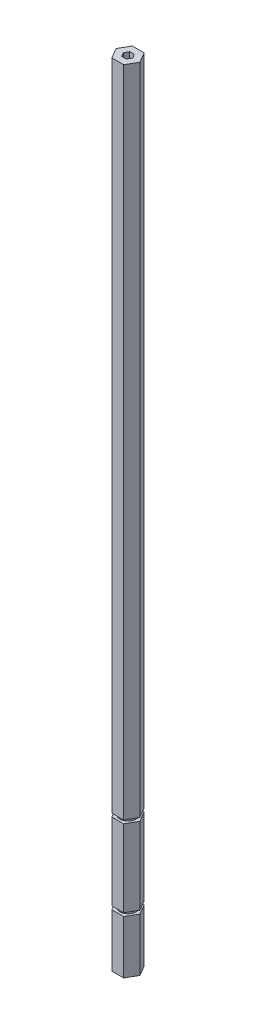
ISO-10303-21;
HEADER;
FILE_DESCRIPTION(('STEP AP214'),'2;1');
FILE_NAME('part.step','',(''),(''),'','','');
FILE_SCHEMA(('AUTOMOTIVE_DESIGN { 1 0 10303 214 1 1 1 1 }'));
ENDSEC;
DATA;
#1=APPLICATION_CONTEXT('core data for automotive mechanical design processes');
#2=APPLICATION_PROTOCOL_DEFINITION('international standard','automotive_design',2000,#1);
#3=PRODUCT_CONTEXT('',#1,'mechanical');
#4=PRODUCT('Part','Part','',(#3));
#5=PRODUCT_RELATED_PRODUCT_CATEGORY('part','',(#4));
#6=PRODUCT_DEFINITION_FORMATION('','',#4);
#7=PRODUCT_DEFINITION_CONTEXT('part definition',#1,'design');
#8=PRODUCT_DEFINITION('design','',#6,#7);
#9=PRODUCT_DEFINITION_SHAPE('','',#8);
#10=(LENGTH_UNIT() NAMED_UNIT(*) SI_UNIT(.MILLI.,.METRE.));
#11=(NAMED_UNIT(*) PLANE_ANGLE_UNIT() SI_UNIT($,.RADIAN.));
#12=(NAMED_UNIT(*) SI_UNIT($,.STERADIAN.) SOLID_ANGLE_UNIT());
#13=UNCERTAINTY_MEASURE_WITH_UNIT(LENGTH_MEASURE(1.E-05),#10,'distance_accuracy_value','');
#14=(GEOMETRIC_REPRESENTATION_CONTEXT(3) GLOBAL_UNCERTAINTY_ASSIGNED_CONTEXT((#13)) GLOBAL_UNIT_ASSIGNED_CONTEXT((#10,
#11,#12)) REPRESENTATION_CONTEXT('',''));
#15=CARTESIAN_POINT('',(0.,0.,0.));
#16=DIRECTION('',(0.,0.,1.));
#17=DIRECTION('',(1.,0.,0.));
#18=AXIS2_PLACEMENT_3D('',#15,#16,#17);
#19=CARTESIAN_POINT('',(3.66617420935412,488.95,6.35));
#20=DIRECTION('',(-0.866025403784439,0.,-0.5));
#21=DIRECTION('',(-0.5,0.,0.866025403784439));
#22=AXIS2_PLACEMENT_3D('',#19,#20,#21);
#23=PLANE('',#22);
#24=DIRECTION('',(-0.5,0.,0.866025403784439));
#25=VECTOR('',#24,1.);
#26=CARTESIAN_POINT('',(3.66617420935412,84.582,6.35));
#27=LINE('',#26,#25);
#28=CARTESIAN_POINT('',(7.33234841870825,84.582,0.));
#29=VERTEX_POINT('',#28);
#30=CARTESIAN_POINT('',(3.66617420935412,84.582,6.35));
#31=VERTEX_POINT('',#30);
#32=EDGE_CURVE('E330',#29,#31,#27,.T.);
#33=ORIENTED_EDGE('',*,*,#32,.F.);
#34=DIRECTION('',(0.,-1.,0.));
#35=VECTOR('',#34,1.);
#36=CARTESIAN_POINT('',(7.33234841870825,488.95,0.));
#37=LINE('',#36,#35);
#38=CARTESIAN_POINT('',(7.33234841870825,488.95,0.));
#39=VERTEX_POINT('',#38);
#40=EDGE_CURVE('E221',#39,#29,#37,.T.);
#41=ORIENTED_EDGE('',*,*,#40,.F.);
#42=DIRECTION('',(0.5,0.,-0.866025403784438));
#43=VECTOR('',#42,1.);
#44=CARTESIAN_POINT('',(3.66617420935412,488.95,6.35));
#45=LINE('',#44,#43);
#46=CARTESIAN_POINT('',(3.66617420935412,488.95,6.35));
#47=VERTEX_POINT('',#46);
#48=EDGE_CURVE('E329',#47,#39,#45,.T.);
#49=ORIENTED_EDGE('',*,*,#48,.F.);
#50=DIRECTION('',(0.,-1.,0.));
#51=VECTOR('',#50,1.);
#52=CARTESIAN_POINT('',(3.66617420935412,488.95,6.35));
#53=LINE('',#52,#51);
#54=EDGE_CURVE('E240',#47,#31,#53,.T.);
#55=ORIENTED_EDGE('',*,*,#54,.T.);
#56=EDGE_LOOP('',(#33,#41,#49,#55));
#57=FACE_BOUND('',#56,.T.);
#58=ADVANCED_FACE('F45',(#57),#23,.F.);
#59=DIRECTION('',(0.5,0.,-0.866025403784439));
#60=VECTOR('',#59,1.);
#61=CARTESIAN_POINT('',(3.66617420935412,32.893,6.35));
#62=LINE('',#61,#60);
#63=CARTESIAN_POINT('',(3.66617420935412,32.893,6.35));
#64=VERTEX_POINT('',#63);
#65=CARTESIAN_POINT('',(7.33234841870825,32.893,0.));
#66=VERTEX_POINT('',#65);
#67=EDGE_CURVE('E215',#64,#66,#62,.T.);
#68=ORIENTED_EDGE('',*,*,#67,.F.);
#69=CARTESIAN_POINT('',(3.66617420935412,0.,6.35));
#70=VERTEX_POINT('',#69);
#71=EDGE_CURVE('E227',#64,#70,#53,.T.);
#72=ORIENTED_EDGE('',*,*,#71,.T.);
#73=DIRECTION('',(0.5,0.,-0.866025403784438));
#74=VECTOR('',#73,1.);
#75=CARTESIAN_POINT('',(3.66617420935412,0.,6.35));
#76=LINE('',#75,#74);
#77=CARTESIAN_POINT('',(7.33234841870825,0.,0.));
#78=VERTEX_POINT('',#77);
#79=EDGE_CURVE('E399',#70,#78,#76,.T.);
#80=ORIENTED_EDGE('',*,*,#79,.T.);
#81=EDGE_CURVE('E229',#66,#78,#37,.T.);
#82=ORIENTED_EDGE('',*,*,#81,.F.);
#83=EDGE_LOOP('',(#68,#72,#80,#82));
#84=FACE_BOUND('',#83,.T.);
#85=ADVANCED_FACE('F225',(#84),#23,.F.);
#86=CARTESIAN_POINT('',(7.33234841870825,488.95,0.));
#87=DIRECTION('',(-0.866025403784439,0.,0.5));
#88=DIRECTION('',(0.5,0.,0.866025403784439));
#89=AXIS2_PLACEMENT_3D('',#86,#87,#88);
#90=PLANE('',#89);
#91=DIRECTION('',(0.5,0.,0.866025403784439));
#92=VECTOR('',#91,1.);
#93=CARTESIAN_POINT('',(7.33234841870825,84.582,0.));
#94=LINE('',#93,#92);
#95=CARTESIAN_POINT('',(3.66617420935412,84.582,-6.35));
#96=VERTEX_POINT('',#95);
#97=EDGE_CURVE('E326',#96,#29,#94,.T.);
#98=ORIENTED_EDGE('',*,*,#97,.F.);
#99=DIRECTION('',(0.,-1.,0.));
#100=VECTOR('',#99,1.);
#101=CARTESIAN_POINT('',(3.66617420935412,488.95,-6.35));
#102=LINE('',#101,#100);
#103=CARTESIAN_POINT('',(3.66617420935412,488.95,-6.35));
#104=VERTEX_POINT('',#103);
#105=EDGE_CURVE('E303',#104,#96,#102,.T.);
#106=ORIENTED_EDGE('',*,*,#105,.F.);
#107=DIRECTION('',(-0.5,0.,-0.866025403784439));
#108=VECTOR('',#107,1.);
#109=CARTESIAN_POINT('',(7.33234841870825,488.95,0.));
#110=LINE('',#109,#108);
#111=EDGE_CURVE('E327',#39,#104,#110,.T.);
#112=ORIENTED_EDGE('',*,*,#111,.F.);
#113=ORIENTED_EDGE('',*,*,#40,.T.);
#114=EDGE_LOOP('',(#98,#106,#112,#113));
#115=FACE_BOUND('',#114,.T.);
#116=ADVANCED_FACE('F325',(#115),#90,.F.);
#117=DIRECTION('',(-0.5,0.,-0.866025403784439));
#118=VECTOR('',#117,1.);
#119=CARTESIAN_POINT('',(7.33234841870825,32.893,0.));
#120=LINE('',#119,#118);
#121=CARTESIAN_POINT('',(3.66617420935412,32.893,-6.35));
#122=VERTEX_POINT('',#121);
#123=EDGE_CURVE('E231',#66,#122,#120,.T.);
#124=ORIENTED_EDGE('',*,*,#123,.F.);
#125=ORIENTED_EDGE('',*,*,#81,.T.);
#126=DIRECTION('',(-0.5,0.,-0.866025403784439));
#127=VECTOR('',#126,1.);
#128=CARTESIAN_POINT('',(7.33234841870825,0.,0.));
#129=LINE('',#128,#127);
#130=CARTESIAN_POINT('',(3.66617420935412,0.,-6.35));
#131=VERTEX_POINT('',#130);
#132=EDGE_CURVE('E411',#78,#131,#129,.T.);
#133=ORIENTED_EDGE('',*,*,#132,.T.);
#134=EDGE_CURVE('E296',#122,#131,#102,.T.);
#135=ORIENTED_EDGE('',*,*,#134,.F.);
#136=EDGE_LOOP('',(#124,#125,#133,#135));
#137=FACE_BOUND('',#136,.T.);
#138=ADVANCED_FACE('F425',(#137),#90,.F.);
#139=CARTESIAN_POINT('',(3.66617420935412,488.95,-6.35));
#140=DIRECTION('',(0.,0.,1.));
#141=DIRECTION('',(1.,0.,0.));
#142=AXIS2_PLACEMENT_3D('',#139,#140,#141);
#143=PLANE('',#142);
#144=DIRECTION('',(1.,0.,0.));
#145=VECTOR('',#144,1.);
#146=CARTESIAN_POINT('',(3.66617420935412,84.582,-6.35));
#147=LINE('',#146,#145);
#148=CARTESIAN_POINT('',(-3.66617420935412,84.582,-6.35));
#149=VERTEX_POINT('',#148);
#150=EDGE_CURVE('E336',#149,#96,#147,.T.);
#151=ORIENTED_EDGE('',*,*,#150,.F.);
#152=DIRECTION('',(0.,-1.,0.));
#153=VECTOR('',#152,1.);
#154=CARTESIAN_POINT('',(-3.66617420935412,488.95,-6.35));
#155=LINE('',#154,#153);
#156=CARTESIAN_POINT('',(-3.66617420935412,488.95,-6.35));
#157=VERTEX_POINT('',#156);
#158=EDGE_CURVE('E287',#157,#149,#155,.T.);
#159=ORIENTED_EDGE('',*,*,#158,.F.);
#160=DIRECTION('',(-1.,0.,0.));
#161=VECTOR('',#160,1.);
#162=CARTESIAN_POINT('',(3.66617420935412,488.95,-6.35));
#163=LINE('',#162,#161);
#164=EDGE_CURVE('E402',#104,#157,#163,.T.);
#165=ORIENTED_EDGE('',*,*,#164,.F.);
#166=ORIENTED_EDGE('',*,*,#105,.T.);
#167=EDGE_LOOP('',(#151,#159,#165,#166));
#168=FACE_BOUND('',#167,.T.);
#169=ADVANCED_FACE('F448',(#168),#143,.F.);
#170=DIRECTION('',(-1.,0.,0.));
#171=VECTOR('',#170,1.);
#172=CARTESIAN_POINT('',(3.66617420935412,32.893,-6.35));
#173=LINE('',#172,#171);
#174=CARTESIAN_POINT('',(-3.66617420935412,32.893,-6.35));
#175=VERTEX_POINT('',#174);
#176=EDGE_CURVE('E426',#122,#175,#173,.T.);
#177=ORIENTED_EDGE('',*,*,#176,.F.);
#178=ORIENTED_EDGE('',*,*,#134,.T.);
#179=DIRECTION('',(-1.,0.,0.));
#180=VECTOR('',#179,1.);
#181=CARTESIAN_POINT('',(3.66617420935412,0.,-6.35));
#182=LINE('',#181,#180);
#183=CARTESIAN_POINT('',(-3.66617420935412,0.,-6.35));
#184=VERTEX_POINT('',#183);
#185=EDGE_CURVE('E413',#131,#184,#182,.T.);
#186=ORIENTED_EDGE('',*,*,#185,.T.);
#187=EDGE_CURVE('E279',#175,#184,#155,.T.);
#188=ORIENTED_EDGE('',*,*,#187,.F.);
#189=EDGE_LOOP('',(#177,#178,#186,#188));
#190=FACE_BOUND('',#189,.T.);
#191=ADVANCED_FACE('F493',(#190),#143,.F.);
#192=CARTESIAN_POINT('',(-3.66617420935412,488.95,-6.35));
#193=DIRECTION('',(0.866025403784438,0.,0.5));
#194=DIRECTION('',(0.5,0.,-0.866025403784439));
#195=AXIS2_PLACEMENT_3D('',#192,#193,#194);
#196=PLANE('',#195);
#197=DIRECTION('',(0.5,0.,-0.866025403784439));
#198=VECTOR('',#197,1.);
#199=CARTESIAN_POINT('',(-3.66617420935412,84.582,-6.35));
#200=LINE('',#199,#198);
#201=CARTESIAN_POINT('',(-7.33234841870825,84.582,0.));
#202=VERTEX_POINT('',#201);
#203=EDGE_CURVE('E444',#202,#149,#200,.T.);
#204=ORIENTED_EDGE('',*,*,#203,.F.);
#205=DIRECTION('',(0.,-1.,0.));
#206=VECTOR('',#205,1.);
#207=CARTESIAN_POINT('',(-7.33234841870825,488.95,0.));
#208=LINE('',#207,#206);
#209=CARTESIAN_POINT('',(-7.33234841870825,488.95,0.));
#210=VERTEX_POINT('',#209);
#211=EDGE_CURVE('E270',#210,#202,#208,.T.);
#212=ORIENTED_EDGE('',*,*,#211,.F.);
#213=DIRECTION('',(-0.5,0.,0.866025403784438));
#214=VECTOR('',#213,1.);
#215=CARTESIAN_POINT('',(-3.66617420935412,488.95,-6.35));
#216=LINE('',#215,#214);
#217=EDGE_CURVE('E405',#157,#210,#216,.T.);
#218=ORIENTED_EDGE('',*,*,#217,.F.);
#219=ORIENTED_EDGE('',*,*,#158,.T.);
#220=EDGE_LOOP('',(#204,#212,#218,#219));
#221=FACE_BOUND('',#220,.T.);
#222=ADVANCED_FACE('F449',(#221),#196,.F.);
#223=DIRECTION('',(-0.5,0.,0.866025403784439));
#224=VECTOR('',#223,1.);
#225=CARTESIAN_POINT('',(-3.66617420935412,32.893,-6.35));
#226=LINE('',#225,#224);
#227=CARTESIAN_POINT('',(-7.33234841870825,32.893,0.));
#228=VERTEX_POINT('',#227);
#229=EDGE_CURVE('E428',#175,#228,#226,.T.);
#230=ORIENTED_EDGE('',*,*,#229,.F.);
#231=ORIENTED_EDGE('',*,*,#187,.T.);
#232=DIRECTION('',(-0.5,0.,0.866025403784438));
#233=VECTOR('',#232,1.);
#234=CARTESIAN_POINT('',(-3.66617420935412,0.,-6.35));
#235=LINE('',#234,#233);
#236=CARTESIAN_POINT('',(-7.33234841870825,0.,0.));
#237=VERTEX_POINT('',#236);
#238=EDGE_CURVE('E415',#184,#237,#235,.T.);
#239=ORIENTED_EDGE('',*,*,#238,.T.);
#240=EDGE_CURVE('E262',#228,#237,#208,.T.);
#241=ORIENTED_EDGE('',*,*,#240,.F.);
#242=EDGE_LOOP('',(#230,#231,#239,#241));
#243=FACE_BOUND('',#242,.T.);
#244=ADVANCED_FACE('F487',(#243),#196,.F.);
#245=CARTESIAN_POINT('',(-7.33234841870825,488.95,0.));
#246=DIRECTION('',(0.866025403784439,0.,-0.5));
#247=DIRECTION('',(-0.5,0.,-0.866025403784439));
#248=AXIS2_PLACEMENT_3D('',#245,#246,#247);
#249=PLANE('',#248);
#250=DIRECTION('',(-0.5,0.,-0.866025403784439));
#251=VECTOR('',#250,1.);
#252=CARTESIAN_POINT('',(-7.33234841870825,84.582,0.));
#253=LINE('',#252,#251);
#254=CARTESIAN_POINT('',(-3.66617420935412,84.582,6.35));
#255=VERTEX_POINT('',#254);
#256=EDGE_CURVE('E441',#255,#202,#253,.T.);
#257=ORIENTED_EDGE('',*,*,#256,.F.);
#258=DIRECTION('',(0.,-1.,0.));
#259=VECTOR('',#258,1.);
#260=CARTESIAN_POINT('',(-3.66617420935412,488.95,6.35));
#261=LINE('',#260,#259);
#262=CARTESIAN_POINT('',(-3.66617420935412,488.95,6.35));
#263=VERTEX_POINT('',#262);
#264=EDGE_CURVE('E256',#263,#255,#261,.T.);
#265=ORIENTED_EDGE('',*,*,#264,.F.);
#266=DIRECTION('',(0.5,0.,0.866025403784439));
#267=VECTOR('',#266,1.);
#268=CARTESIAN_POINT('',(-7.33234841870825,488.95,0.));
#269=LINE('',#268,#267);
#270=EDGE_CURVE('E242',#210,#263,#269,.T.);
#271=ORIENTED_EDGE('',*,*,#270,.F.);
#272=ORIENTED_EDGE('',*,*,#211,.T.);
#273=EDGE_LOOP('',(#257,#265,#271,#272));
#274=FACE_BOUND('',#273,.T.);
#275=ADVANCED_FACE('F495',(#274),#249,.F.);
#276=DIRECTION('',(0.5,0.,0.866025403784439));
#277=VECTOR('',#276,1.);
#278=CARTESIAN_POINT('',(-7.33234841870825,32.893,0.));
#279=LINE('',#278,#277);
#280=CARTESIAN_POINT('',(-3.66617420935412,32.893,6.35));
#281=VERTEX_POINT('',#280);
#282=EDGE_CURVE('E60',#228,#281,#279,.T.);
#283=ORIENTED_EDGE('',*,*,#282,.F.);
#284=ORIENTED_EDGE('',*,*,#240,.T.);
#285=DIRECTION('',(0.5,0.,0.866025403784439));
#286=VECTOR('',#285,1.);
#287=CARTESIAN_POINT('',(-7.33234841870825,0.,0.));
#288=LINE('',#287,#286);
#289=CARTESIAN_POINT('',(-3.66617420935412,0.,6.35));
#290=VERTEX_POINT('',#289);
#291=EDGE_CURVE('E417',#237,#290,#288,.T.);
#292=ORIENTED_EDGE('',*,*,#291,.T.);
#293=EDGE_CURVE('E248',#281,#290,#261,.T.);
#294=ORIENTED_EDGE('',*,*,#293,.F.);
#295=EDGE_LOOP('',(#283,#284,#292,#294));
#296=FACE_BOUND('',#295,.T.);
#297=ADVANCED_FACE('F419',(#296),#249,.F.);
#298=CARTESIAN_POINT('',(-3.66617420935412,488.95,6.35));
#299=DIRECTION('',(0.,0.,-1.));
#300=DIRECTION('',(-1.,0.,0.));
#301=AXIS2_PLACEMENT_3D('',#298,#299,#300);
#302=PLANE('',#301);
#303=DIRECTION('',(-1.,0.,0.));
#304=VECTOR('',#303,1.);
#305=CARTESIAN_POINT('',(-3.66617420935412,84.582,6.35));
#306=LINE('',#305,#304);
#307=EDGE_CURVE('E53',#31,#255,#306,.T.);
#308=ORIENTED_EDGE('',*,*,#307,.F.);
#309=ORIENTED_EDGE('',*,*,#54,.F.);
#310=DIRECTION('',(1.,0.,0.));
#311=VECTOR('',#310,1.);
#312=CARTESIAN_POINT('',(-3.66617420935412,488.95,6.35));
#313=LINE('',#312,#311);
#314=EDGE_CURVE('E238',#263,#47,#313,.T.);
#315=ORIENTED_EDGE('',*,*,#314,.F.);
#316=ORIENTED_EDGE('',*,*,#264,.T.);
#317=EDGE_LOOP('',(#308,#309,#315,#316));
#318=FACE_BOUND('',#317,.T.);
#319=ADVANCED_FACE('F453',(#318),#302,.F.);
#320=DIRECTION('',(1.,0.,0.));
#321=VECTOR('',#320,1.);
#322=CARTESIAN_POINT('',(-3.66617420935412,32.893,6.35));
#323=LINE('',#322,#321);
#324=EDGE_CURVE('E212',#281,#64,#323,.T.);
#325=ORIENTED_EDGE('',*,*,#324,.F.);
#326=ORIENTED_EDGE('',*,*,#293,.T.);
#327=DIRECTION('',(1.,0.,0.));
#328=VECTOR('',#327,1.);
#329=CARTESIAN_POINT('',(-3.66617420935412,0.,6.35));
#330=LINE('',#329,#328);
#331=EDGE_CURVE('E235',#290,#70,#330,.T.);
#332=ORIENTED_EDGE('',*,*,#331,.T.);
#333=ORIENTED_EDGE('',*,*,#71,.F.);
#334=EDGE_LOOP('',(#325,#326,#332,#333));
#335=FACE_BOUND('',#334,.T.);
#336=ADVANCED_FACE('F233',(#335),#302,.F.);
#337=CARTESIAN_POINT('',(0.,488.95,0.));
#338=DIRECTION('',(0.,1.,0.));
#339=DIRECTION('',(0.,0.,1.));
#340=AXIS2_PLACEMENT_3D('',#337,#338,#339);
#341=PLANE('',#340);
#342=ORIENTED_EDGE('',*,*,#48,.T.);
#343=ORIENTED_EDGE('',*,*,#111,.T.);
#344=ORIENTED_EDGE('',*,*,#164,.T.);
#345=ORIENTED_EDGE('',*,*,#217,.T.);
#346=ORIENTED_EDGE('',*,*,#270,.T.);
#347=ORIENTED_EDGE('',*,*,#314,.T.);
#348=EDGE_LOOP('',(#342,#343,#344,#345,#346,#347));
#349=FACE_BOUND('',#348,.T.);
#350=DIRECTION('',(-1.,0.,0.));
#351=VECTOR('',#350,1.);
#352=CARTESIAN_POINT('',(1.44337567297407,488.95,-2.5));
#353=LINE('',#352,#351);
#354=CARTESIAN_POINT('',(1.44337567297407,488.95,-2.5));
#355=VERTEX_POINT('',#354);
#356=CARTESIAN_POINT('',(-1.44337567297406,488.95,-2.5));
#357=VERTEX_POINT('',#356);
#358=EDGE_CURVE('E353',#355,#357,#353,.T.);
#359=ORIENTED_EDGE('',*,*,#358,.F.);
#360=DIRECTION('',(-0.5,0.,-0.866025403784438));
#361=VECTOR('',#360,1.);
#362=CARTESIAN_POINT('',(2.88675134594813,488.95,0.));
#363=LINE('',#362,#361);
#364=CARTESIAN_POINT('',(2.88675134594813,488.95,0.));
#365=VERTEX_POINT('',#364);
#366=EDGE_CURVE('E350',#365,#355,#363,.T.);
#367=ORIENTED_EDGE('',*,*,#366,.F.);
#368=DIRECTION('',(0.5,0.,-0.866025403784438));
#369=VECTOR('',#368,1.);
#370=CARTESIAN_POINT('',(1.44337567297406,488.95,2.5));
#371=LINE('',#370,#369);
#372=CARTESIAN_POINT('',(1.44337567297406,488.95,2.5));
#373=VERTEX_POINT('',#372);
#374=EDGE_CURVE('E366',#373,#365,#371,.T.);
#375=ORIENTED_EDGE('',*,*,#374,.F.);
#376=DIRECTION('',(1.,0.,0.));
#377=VECTOR('',#376,1.);
#378=CARTESIAN_POINT('',(-1.44337567297406,488.95,2.5));
#379=LINE('',#378,#377);
#380=CARTESIAN_POINT('',(-1.44337567297406,488.95,2.5));
#381=VERTEX_POINT('',#380);
#382=EDGE_CURVE('E363',#381,#373,#379,.T.);
#383=ORIENTED_EDGE('',*,*,#382,.F.);
#384=DIRECTION('',(0.5,0.,0.866025403784439));
#385=VECTOR('',#384,1.);
#386=CARTESIAN_POINT('',(-2.88675134594813,488.95,0.));
#387=LINE('',#386,#385);
#388=CARTESIAN_POINT('',(-2.88675134594813,488.95,0.));
#389=VERTEX_POINT('',#388);
#390=EDGE_CURVE('E360',#389,#381,#387,.T.);
#391=ORIENTED_EDGE('',*,*,#390,.F.);
#392=DIRECTION('',(-0.5,0.,0.866025403784439));
#393=VECTOR('',#392,1.);
#394=CARTESIAN_POINT('',(-1.44337567297406,488.95,-2.5));
#395=LINE('',#394,#393);
#396=EDGE_CURVE('E357',#357,#389,#395,.T.);
#397=ORIENTED_EDGE('',*,*,#396,.F.);
#398=EDGE_LOOP('',(#359,#367,#375,#383,#391,#397));
#399=FACE_BOUND('',#398,.T.);
#400=ADVANCED_FACE('F451',(#349,#399),#341,.T.);
#401=CARTESIAN_POINT('',(0.,0.,0.));
#402=DIRECTION('',(0.,1.,0.));
#403=DIRECTION('',(0.,0.,1.));
#404=AXIS2_PLACEMENT_3D('',#401,#402,#403);
#405=PLANE('',#404);
#406=ORIENTED_EDGE('',*,*,#79,.F.);
#407=ORIENTED_EDGE('',*,*,#331,.F.);
#408=ORIENTED_EDGE('',*,*,#291,.F.);
#409=ORIENTED_EDGE('',*,*,#238,.F.);
#410=ORIENTED_EDGE('',*,*,#185,.F.);
#411=ORIENTED_EDGE('',*,*,#132,.F.);
#412=EDGE_LOOP('',(#406,#407,#408,#409,#410,#411));
#413=FACE_BOUND('',#412,.T.);
#414=DIRECTION('',(-0.5,0.,-0.866025403784438));
#415=VECTOR('',#414,1.);
#416=CARTESIAN_POINT('',(2.88675134594813,0.,0.));
#417=LINE('',#416,#415);
#418=CARTESIAN_POINT('',(2.88675134594813,0.,0.));
#419=VERTEX_POINT('',#418);
#420=CARTESIAN_POINT('',(1.44337567297407,0.,-2.5));
#421=VERTEX_POINT('',#420);
#422=EDGE_CURVE('E349',#419,#421,#417,.T.);
#423=ORIENTED_EDGE('',*,*,#422,.T.);
#424=DIRECTION('',(-1.,0.,0.));
#425=VECTOR('',#424,1.);
#426=CARTESIAN_POINT('',(1.44337567297407,0.,-2.5));
#427=LINE('',#426,#425);
#428=CARTESIAN_POINT('',(-1.44337567297406,0.,-2.5));
#429=VERTEX_POINT('',#428);
#430=EDGE_CURVE('E371',#421,#429,#427,.T.);
#431=ORIENTED_EDGE('',*,*,#430,.T.);
#432=DIRECTION('',(-0.5,0.,0.866025403784439));
#433=VECTOR('',#432,1.);
#434=CARTESIAN_POINT('',(-1.44337567297406,0.,-2.5));
#435=LINE('',#434,#433);
#436=CARTESIAN_POINT('',(-2.88675134594813,0.,0.));
#437=VERTEX_POINT('',#436);
#438=EDGE_CURVE('E374',#429,#437,#435,.T.);
#439=ORIENTED_EDGE('',*,*,#438,.T.);
#440=DIRECTION('',(0.5,0.,0.866025403784439));
#441=VECTOR('',#440,1.);
#442=CARTESIAN_POINT('',(-2.88675134594813,0.,0.));
#443=LINE('',#442,#441);
#444=CARTESIAN_POINT('',(-1.44337567297406,0.,2.5));
#445=VERTEX_POINT('',#444);
#446=EDGE_CURVE('E377',#437,#445,#443,.T.);
#447=ORIENTED_EDGE('',*,*,#446,.T.);
#448=DIRECTION('',(1.,0.,0.));
#449=VECTOR('',#448,1.);
#450=CARTESIAN_POINT('',(-1.44337567297406,0.,2.5));
#451=LINE('',#450,#449);
#452=CARTESIAN_POINT('',(1.44337567297406,0.,2.5));
#453=VERTEX_POINT('',#452);
#454=EDGE_CURVE('E380',#445,#453,#451,.T.);
#455=ORIENTED_EDGE('',*,*,#454,.T.);
#456=DIRECTION('',(0.5,0.,-0.866025403784438));
#457=VECTOR('',#456,1.);
#458=CARTESIAN_POINT('',(1.44337567297406,0.,2.5));
#459=LINE('',#458,#457);
#460=EDGE_CURVE('E354',#453,#419,#459,.T.);
#461=ORIENTED_EDGE('',*,*,#460,.T.);
#462=EDGE_LOOP('',(#423,#431,#439,#447,#455,#461));
#463=FACE_BOUND('',#462,.T.);
#464=ADVANCED_FACE('F422',(#413,#463),#405,.F.);
#465=CARTESIAN_POINT('',(2.88675134594813,488.95,0.));
#466=DIRECTION('',(-0.866025403784438,0.,0.5));
#467=DIRECTION('',(0.5,0.,0.866025403784439));
#468=AXIS2_PLACEMENT_3D('',#465,#466,#467);
#469=PLANE('',#468);
#470=ORIENTED_EDGE('',*,*,#422,.F.);
#471=DIRECTION('',(0.,-1.,0.));
#472=VECTOR('',#471,1.);
#473=CARTESIAN_POINT('',(2.88675134594813,488.95,0.));
#474=LINE('',#473,#472);
#475=EDGE_CURVE('E368',#365,#419,#474,.T.);
#476=ORIENTED_EDGE('',*,*,#475,.F.);
#477=ORIENTED_EDGE('',*,*,#366,.T.);
#478=DIRECTION('',(0.,-1.,0.));
#479=VECTOR('',#478,1.);
#480=CARTESIAN_POINT('',(1.44337567297407,488.95,-2.5));
#481=LINE('',#480,#479);
#482=EDGE_CURVE('E396',#355,#421,#481,.T.);
#483=ORIENTED_EDGE('',*,*,#482,.T.);
#484=EDGE_LOOP('',(#470,#476,#477,#483));
#485=FACE_BOUND('',#484,.T.);
#486=ADVANCED_FACE('F578',(#485),#469,.T.);
#487=CARTESIAN_POINT('',(1.44337567297407,488.95,-2.5));
#488=DIRECTION('',(0.,0.,1.));
#489=DIRECTION('',(1.,0.,0.));
#490=AXIS2_PLACEMENT_3D('',#487,#488,#489);
#491=PLANE('',#490);
#492=ORIENTED_EDGE('',*,*,#430,.F.);
#493=ORIENTED_EDGE('',*,*,#482,.F.);
#494=ORIENTED_EDGE('',*,*,#358,.T.);
#495=DIRECTION('',(0.,-1.,0.));
#496=VECTOR('',#495,1.);
#497=CARTESIAN_POINT('',(-1.44337567297406,488.95,-2.5));
#498=LINE('',#497,#496);
#499=EDGE_CURVE('E393',#357,#429,#498,.T.);
#500=ORIENTED_EDGE('',*,*,#499,.T.);
#501=EDGE_LOOP('',(#492,#493,#494,#500));
#502=FACE_BOUND('',#501,.T.);
#503=ADVANCED_FACE('F574',(#502),#491,.T.);
#504=CARTESIAN_POINT('',(-1.44337567297406,488.95,-2.5));
#505=DIRECTION('',(0.866025403784439,0.,0.5));
#506=DIRECTION('',(0.5,0.,-0.866025403784439));
#507=AXIS2_PLACEMENT_3D('',#504,#505,#506);
#508=PLANE('',#507);
#509=ORIENTED_EDGE('',*,*,#438,.F.);
#510=ORIENTED_EDGE('',*,*,#499,.F.);
#511=ORIENTED_EDGE('',*,*,#396,.T.);
#512=DIRECTION('',(0.,-1.,0.));
#513=VECTOR('',#512,1.);
#514=CARTESIAN_POINT('',(-2.88675134594813,488.95,0.));
#515=LINE('',#514,#513);
#516=EDGE_CURVE('E391',#389,#437,#515,.T.);
#517=ORIENTED_EDGE('',*,*,#516,.T.);
#518=EDGE_LOOP('',(#509,#510,#511,#517));
#519=FACE_BOUND('',#518,.T.);
#520=ADVANCED_FACE('F570',(#519),#508,.T.);
#521=CARTESIAN_POINT('',(-2.88675134594813,488.95,0.));
#522=DIRECTION('',(0.866025403784439,0.,-0.5));
#523=DIRECTION('',(-0.5,0.,-0.866025403784439));
#524=AXIS2_PLACEMENT_3D('',#521,#522,#523);
#525=PLANE('',#524);
#526=ORIENTED_EDGE('',*,*,#446,.F.);
#527=ORIENTED_EDGE('',*,*,#516,.F.);
#528=ORIENTED_EDGE('',*,*,#390,.T.);
#529=DIRECTION('',(0.,-1.,0.));
#530=VECTOR('',#529,1.);
#531=CARTESIAN_POINT('',(-1.44337567297406,488.95,2.5));
#532=LINE('',#531,#530);
#533=EDGE_CURVE('E389',#381,#445,#532,.T.);
#534=ORIENTED_EDGE('',*,*,#533,.T.);
#535=EDGE_LOOP('',(#526,#527,#528,#534));
#536=FACE_BOUND('',#535,.T.);
#537=ADVANCED_FACE('F566',(#536),#525,.T.);
#538=CARTESIAN_POINT('',(-1.44337567297406,488.95,2.5));
#539=DIRECTION('',(0.,0.,-1.));
#540=DIRECTION('',(-1.,0.,0.));
#541=AXIS2_PLACEMENT_3D('',#538,#539,#540);
#542=PLANE('',#541);
#543=ORIENTED_EDGE('',*,*,#454,.F.);
#544=ORIENTED_EDGE('',*,*,#533,.F.);
#545=ORIENTED_EDGE('',*,*,#382,.T.);
#546=DIRECTION('',(0.,-1.,0.));
#547=VECTOR('',#546,1.);
#548=CARTESIAN_POINT('',(1.44337567297406,488.95,2.5));
#549=LINE('',#548,#547);
#550=EDGE_CURVE('E387',#373,#453,#549,.T.);
#551=ORIENTED_EDGE('',*,*,#550,.T.);
#552=EDGE_LOOP('',(#543,#544,#545,#551));
#553=FACE_BOUND('',#552,.T.);
#554=ADVANCED_FACE('F562',(#553),#542,.T.);
#555=CARTESIAN_POINT('',(1.44337567297406,488.95,2.5));
#556=DIRECTION('',(-0.866025403784438,0.,-0.5));
#557=DIRECTION('',(-0.5,0.,0.866025403784439));
#558=AXIS2_PLACEMENT_3D('',#555,#556,#557);
#559=PLANE('',#558);
#560=ORIENTED_EDGE('',*,*,#460,.F.);
#561=ORIENTED_EDGE('',*,*,#550,.F.);
#562=ORIENTED_EDGE('',*,*,#374,.T.);
#563=ORIENTED_EDGE('',*,*,#475,.T.);
#564=EDGE_LOOP('',(#560,#561,#562,#563));
#565=FACE_BOUND('',#564,.T.);
#566=ADVANCED_FACE('F558',(#565),#559,.T.);
#567=CARTESIAN_POINT('',(0.,34.925,-5.01650000000001));
#568=DIRECTION('',(0.,-1.,0.));
#569=DIRECTION('',(0.,0.,-1.));
#570=AXIS2_PLACEMENT_3D('',#567,#568,#569);
#571=PLANE('',#570);
#572=CARTESIAN_POINT('',(0.,34.925,0.));
#573=DIRECTION('',(0.,1.,0.));
#574=DIRECTION('',(0.,0.,1.));
#575=AXIS2_PLACEMENT_3D('',#572,#573,#574);
#576=CIRCLE('',#575,5.01650000000002);
#577=CARTESIAN_POINT('',(0.,34.925,5.01650000000002));
#578=VERTEX_POINT('',#577);
#579=EDGE_CURVE('E525',#578,#578,#576,.T.);
#580=ORIENTED_EDGE('',*,*,#579,.T.);
#581=EDGE_LOOP('',(#580));
#582=FACE_BOUND('',#581,.T.);
#583=DIRECTION('',(-0.5,0.,0.866025403784439));
#584=VECTOR('',#583,1.);
#585=CARTESIAN_POINT('',(3.66617420935412,34.925,6.35));
#586=LINE('',#585,#584);
#587=CARTESIAN_POINT('',(7.33234841870825,34.925,0.));
#588=VERTEX_POINT('',#587);
#589=CARTESIAN_POINT('',(3.66617420935412,34.925,6.35));
#590=VERTEX_POINT('',#589);
#591=EDGE_CURVE('E439',#588,#590,#586,.T.);
#592=ORIENTED_EDGE('',*,*,#591,.T.);
#593=DIRECTION('',(-1.,0.,0.));
#594=VECTOR('',#593,1.);
#595=CARTESIAN_POINT('',(-3.66617420935412,34.925,6.35));
#596=LINE('',#595,#594);
#597=CARTESIAN_POINT('',(-3.66617420935412,34.925,6.35));
#598=VERTEX_POINT('',#597);
#599=EDGE_CURVE('E220',#590,#598,#596,.T.);
#600=ORIENTED_EDGE('',*,*,#599,.T.);
#601=DIRECTION('',(-0.5,0.,-0.866025403784439));
#602=VECTOR('',#601,1.);
#603=CARTESIAN_POINT('',(-7.33234841870825,34.925,0.));
#604=LINE('',#603,#602);
#605=CARTESIAN_POINT('',(-7.33234841870825,34.925,0.));
#606=VERTEX_POINT('',#605);
#607=EDGE_CURVE('E230',#598,#606,#604,.T.);
#608=ORIENTED_EDGE('',*,*,#607,.T.);
#609=DIRECTION('',(0.5,0.,-0.866025403784439));
#610=VECTOR('',#609,1.);
#611=CARTESIAN_POINT('',(-3.66617420935412,34.925,-6.35));
#612=LINE('',#611,#610);
#613=CARTESIAN_POINT('',(-3.66617420935412,34.925,-6.35));
#614=VERTEX_POINT('',#613);
#615=EDGE_CURVE('E433',#606,#614,#612,.T.);
#616=ORIENTED_EDGE('',*,*,#615,.T.);
#617=DIRECTION('',(1.,0.,0.));
#618=VECTOR('',#617,1.);
#619=CARTESIAN_POINT('',(3.66617420935412,34.925,-6.35));
#620=LINE('',#619,#618);
#621=CARTESIAN_POINT('',(3.66617420935412,34.925,-6.35));
#622=VERTEX_POINT('',#621);
#623=EDGE_CURVE('E435',#614,#622,#620,.T.);
#624=ORIENTED_EDGE('',*,*,#623,.T.);
#625=DIRECTION('',(0.5,0.,0.866025403784439));
#626=VECTOR('',#625,1.);
#627=CARTESIAN_POINT('',(7.33234841870825,34.925,0.));
#628=LINE('',#627,#626);
#629=EDGE_CURVE('E437',#622,#588,#628,.T.);
#630=ORIENTED_EDGE('',*,*,#629,.T.);
#631=EDGE_LOOP('',(#592,#600,#608,#616,#624,#630));
#632=FACE_BOUND('',#631,.T.);
#633=ADVANCED_FACE('F458',(#582,#632),#571,.T.);
#634=CARTESIAN_POINT('',(0.,32.893,-5.01650000000002));
#635=DIRECTION('',(0.,1.,0.));
#636=DIRECTION('',(0.,0.,1.));
#637=AXIS2_PLACEMENT_3D('',#634,#635,#636);
#638=PLANE('',#637);
#639=CARTESIAN_POINT('',(0.,32.893,0.));
#640=DIRECTION('',(0.,1.,0.));
#641=DIRECTION('',(0.,0.,1.));
#642=AXIS2_PLACEMENT_3D('',#639,#640,#641);
#643=CIRCLE('',#642,5.01650000000002);
#644=CARTESIAN_POINT('',(0.,32.893,5.01650000000003));
#645=VERTEX_POINT('',#644);
#646=EDGE_CURVE('E529',#645,#645,#643,.T.);
#647=ORIENTED_EDGE('',*,*,#646,.F.);
#648=EDGE_LOOP('',(#647));
#649=FACE_BOUND('',#648,.T.);
#650=ORIENTED_EDGE('',*,*,#67,.T.);
#651=ORIENTED_EDGE('',*,*,#123,.T.);
#652=ORIENTED_EDGE('',*,*,#176,.T.);
#653=ORIENTED_EDGE('',*,*,#229,.T.);
#654=ORIENTED_EDGE('',*,*,#282,.T.);
#655=ORIENTED_EDGE('',*,*,#324,.T.);
#656=EDGE_LOOP('',(#650,#651,#652,#653,#654,#655));
#657=FACE_BOUND('',#656,.T.);
#658=ADVANCED_FACE('F214',(#649,#657),#638,.T.);
#659=CARTESIAN_POINT('',(0.,488.95,0.));
#660=DIRECTION('',(0.,1.,0.));
#661=DIRECTION('',(0.,0.,1.));
#662=AXIS2_PLACEMENT_3D('',#659,#660,#661);
#663=CYLINDRICAL_SURFACE('',#662,5.01650000000002);
#664=ORIENTED_EDGE('',*,*,#646,.T.);
#665=EDGE_LOOP('',(#664));
#666=FACE_BOUND('',#665,.T.);
#667=ORIENTED_EDGE('',*,*,#579,.F.);
#668=EDGE_LOOP('',(#667));
#669=FACE_BOUND('',#668,.T.);
#670=ADVANCED_FACE('F551',(#666,#669),#663,.T.);
#671=DIRECTION('',(1.,0.,0.));
#672=VECTOR('',#671,1.);
#673=CARTESIAN_POINT('',(-3.66617420935412,82.55,6.35));
#674=LINE('',#673,#672);
#675=CARTESIAN_POINT('',(-3.66617420935412,82.55,6.35));
#676=VERTEX_POINT('',#675);
#677=CARTESIAN_POINT('',(3.66617420935412,82.55,6.35));
#678=VERTEX_POINT('',#677);
#679=EDGE_CURVE('E11',#676,#678,#674,.T.);
#680=ORIENTED_EDGE('',*,*,#679,.F.);
#681=EDGE_CURVE('E255',#676,#598,#261,.T.);
#682=ORIENTED_EDGE('',*,*,#681,.T.);
#683=ORIENTED_EDGE('',*,*,#599,.F.);
#684=EDGE_CURVE('E237',#678,#590,#53,.T.);
#685=ORIENTED_EDGE('',*,*,#684,.F.);
#686=EDGE_LOOP('',(#680,#682,#683,#685));
#687=FACE_BOUND('',#686,.T.);
#688=ADVANCED_FACE('F467',(#687),#302,.F.);
#689=DIRECTION('',(0.5,0.,0.866025403784439));
#690=VECTOR('',#689,1.);
#691=CARTESIAN_POINT('',(-7.33234841870825,82.55,0.));
#692=LINE('',#691,#690);
#693=CARTESIAN_POINT('',(-7.33234841870825,82.55,0.));
#694=VERTEX_POINT('',#693);
#695=EDGE_CURVE('E67',#694,#676,#692,.T.);
#696=ORIENTED_EDGE('',*,*,#695,.F.);
#697=EDGE_CURVE('E269',#694,#606,#208,.T.);
#698=ORIENTED_EDGE('',*,*,#697,.T.);
#699=ORIENTED_EDGE('',*,*,#607,.F.);
#700=ORIENTED_EDGE('',*,*,#681,.F.);
#701=EDGE_LOOP('',(#696,#698,#699,#700));
#702=FACE_BOUND('',#701,.T.);
#703=ADVANCED_FACE('F465',(#702),#249,.F.);
#704=DIRECTION('',(-0.5,0.,0.866025403784439));
#705=VECTOR('',#704,1.);
#706=CARTESIAN_POINT('',(-3.66617420935412,82.55,-6.35));
#707=LINE('',#706,#705);
#708=CARTESIAN_POINT('',(-3.66617420935412,82.55,-6.35));
#709=VERTEX_POINT('',#708);
#710=EDGE_CURVE('E334',#709,#694,#707,.T.);
#711=ORIENTED_EDGE('',*,*,#710,.F.);
#712=EDGE_CURVE('E286',#709,#614,#155,.T.);
#713=ORIENTED_EDGE('',*,*,#712,.T.);
#714=ORIENTED_EDGE('',*,*,#615,.F.);
#715=ORIENTED_EDGE('',*,*,#697,.F.);
#716=EDGE_LOOP('',(#711,#713,#714,#715));
#717=FACE_BOUND('',#716,.T.);
#718=ADVANCED_FACE('F484',(#717),#196,.F.);
#719=DIRECTION('',(-1.,0.,0.));
#720=VECTOR('',#719,1.);
#721=CARTESIAN_POINT('',(3.66617420935412,82.55,-6.35));
#722=LINE('',#721,#720);
#723=CARTESIAN_POINT('',(3.66617420935412,82.55,-6.35));
#724=VERTEX_POINT('',#723);
#725=EDGE_CURVE('E342',#724,#709,#722,.T.);
#726=ORIENTED_EDGE('',*,*,#725,.F.);
#727=EDGE_CURVE('E302',#724,#622,#102,.T.);
#728=ORIENTED_EDGE('',*,*,#727,.T.);
#729=ORIENTED_EDGE('',*,*,#623,.F.);
#730=ORIENTED_EDGE('',*,*,#712,.F.);
#731=EDGE_LOOP('',(#726,#728,#729,#730));
#732=FACE_BOUND('',#731,.T.);
#733=ADVANCED_FACE('F481',(#732),#143,.F.);
#734=DIRECTION('',(-0.5,0.,-0.866025403784439));
#735=VECTOR('',#734,1.);
#736=CARTESIAN_POINT('',(7.33234841870825,82.55,0.));
#737=LINE('',#736,#735);
#738=CARTESIAN_POINT('',(7.33234841870825,82.55,0.));
#739=VERTEX_POINT('',#738);
#740=EDGE_CURVE('E345',#739,#724,#737,.T.);
#741=ORIENTED_EDGE('',*,*,#740,.F.);
#742=EDGE_CURVE('E316',#739,#588,#37,.T.);
#743=ORIENTED_EDGE('',*,*,#742,.T.);
#744=ORIENTED_EDGE('',*,*,#629,.F.);
#745=ORIENTED_EDGE('',*,*,#727,.F.);
#746=EDGE_LOOP('',(#741,#743,#744,#745));
#747=FACE_BOUND('',#746,.T.);
#748=ADVANCED_FACE('F475',(#747),#90,.F.);
#749=DIRECTION('',(0.5,0.,-0.866025403784439));
#750=VECTOR('',#749,1.);
#751=CARTESIAN_POINT('',(3.66617420935412,82.55,6.35));
#752=LINE('',#751,#750);
#753=EDGE_CURVE('E347',#678,#739,#752,.T.);
#754=ORIENTED_EDGE('',*,*,#753,.F.);
#755=ORIENTED_EDGE('',*,*,#684,.T.);
#756=ORIENTED_EDGE('',*,*,#591,.F.);
#757=ORIENTED_EDGE('',*,*,#742,.F.);
#758=EDGE_LOOP('',(#754,#755,#756,#757));
#759=FACE_BOUND('',#758,.T.);
#760=ADVANCED_FACE('F47',(#759),#23,.F.);
#761=CARTESIAN_POINT('',(0.,82.55,-5.01650000000002));
#762=DIRECTION('',(0.,1.,0.));
#763=DIRECTION('',(0.,0.,1.));
#764=AXIS2_PLACEMENT_3D('',#761,#762,#763);
#765=PLANE('',#764);
#766=CARTESIAN_POINT('',(0.,82.55,0.));
#767=DIRECTION('',(0.,1.,0.));
#768=DIRECTION('',(0.,0.,1.));
#769=AXIS2_PLACEMENT_3D('',#766,#767,#768);
#770=CIRCLE('',#769,5.01650000000002);
#771=CARTESIAN_POINT('',(0.,82.55,5.01650000000002));
#772=VERTEX_POINT('',#771);
#773=EDGE_CURVE('E522',#772,#772,#770,.T.);
#774=ORIENTED_EDGE('',*,*,#773,.F.);
#775=EDGE_LOOP('',(#774));
#776=FACE_BOUND('',#775,.T.);
#777=ORIENTED_EDGE('',*,*,#753,.T.);
#778=ORIENTED_EDGE('',*,*,#740,.T.);
#779=ORIENTED_EDGE('',*,*,#725,.T.);
#780=ORIENTED_EDGE('',*,*,#710,.T.);
#781=ORIENTED_EDGE('',*,*,#695,.T.);
#782=ORIENTED_EDGE('',*,*,#679,.T.);
#783=EDGE_LOOP('',(#777,#778,#779,#780,#781,#782));
#784=FACE_BOUND('',#783,.T.);
#785=ADVANCED_FACE('F469',(#776,#784),#765,.T.);
#786=CARTESIAN_POINT('',(0.,84.582,-5.01650000000001));
#787=DIRECTION('',(0.,-1.,0.));
#788=DIRECTION('',(0.,0.,-1.));
#789=AXIS2_PLACEMENT_3D('',#786,#787,#788);
#790=PLANE('',#789);
#791=CARTESIAN_POINT('',(0.,84.582,0.));
#792=DIRECTION('',(0.,1.,0.));
#793=DIRECTION('',(0.,0.,1.));
#794=AXIS2_PLACEMENT_3D('',#791,#792,#793);
#795=CIRCLE('',#794,5.01650000000001);
#796=CARTESIAN_POINT('',(0.,84.582,5.01650000000002));
#797=VERTEX_POINT('',#796);
#798=EDGE_CURVE('E528',#797,#797,#795,.T.);
#799=ORIENTED_EDGE('',*,*,#798,.T.);
#800=EDGE_LOOP('',(#799));
#801=FACE_BOUND('',#800,.T.);
#802=ORIENTED_EDGE('',*,*,#32,.T.);
#803=ORIENTED_EDGE('',*,*,#307,.T.);
#804=ORIENTED_EDGE('',*,*,#256,.T.);
#805=ORIENTED_EDGE('',*,*,#203,.T.);
#806=ORIENTED_EDGE('',*,*,#150,.T.);
#807=ORIENTED_EDGE('',*,*,#97,.T.);
#808=EDGE_LOOP('',(#802,#803,#804,#805,#806,#807));
#809=FACE_BOUND('',#808,.T.);
#810=ADVANCED_FACE('F447',(#801,#809),#790,.T.);
#811=CARTESIAN_POINT('',(0.,488.95,0.));
#812=DIRECTION('',(0.,1.,0.));
#813=DIRECTION('',(0.,0.,1.));
#814=AXIS2_PLACEMENT_3D('',#811,#812,#813);
#815=CYLINDRICAL_SURFACE('',#814,5.01650000000002);
#816=ORIENTED_EDGE('',*,*,#773,.T.);
#817=EDGE_LOOP('',(#816));
#818=FACE_BOUND('',#817,.T.);
#819=ORIENTED_EDGE('',*,*,#798,.F.);
#820=EDGE_LOOP('',(#819));
#821=FACE_BOUND('',#820,.T.);
#822=ADVANCED_FACE('F540',(#818,#821),#815,.T.);
#823=CLOSED_SHELL('',(#58,#85,#116,#138,#169,#191,#222,#244,#275,#297,#319,#336,#400,#464,#486,
#503,#520,#537,#554,#566,#633,#658,#670,#688,#703,#718,#733,#748,#760,#785,#810,#822));
#824=MANIFOLD_SOLID_BREP('B2',#823);
#825=ADVANCED_BREP_SHAPE_REPRESENTATION('',(#18,#824),#14);
#826=SHAPE_DEFINITION_REPRESENTATION(#9,#825);
ENDSEC;
END-ISO-10303-21;
